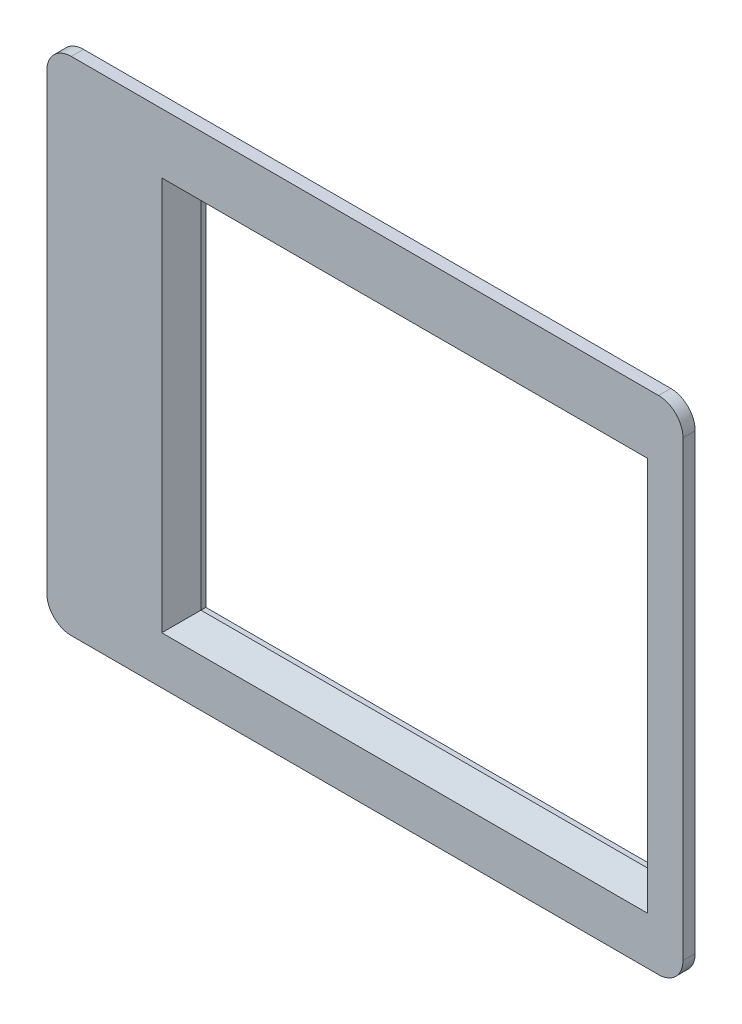
ISO-10303-21;
HEADER;
FILE_DESCRIPTION(('STEP AP214'),'2;1');
FILE_NAME('part.step','',(''),(''),'','','');
FILE_SCHEMA(('AUTOMOTIVE_DESIGN { 1 0 10303 214 1 1 1 1 }'));
ENDSEC;
DATA;
#1=APPLICATION_CONTEXT('core data for automotive mechanical design processes');
#2=APPLICATION_PROTOCOL_DEFINITION('international standard','automotive_design',2000,#1);
#3=PRODUCT_CONTEXT('',#1,'mechanical');
#4=PRODUCT('Part','Part','',(#3));
#5=PRODUCT_RELATED_PRODUCT_CATEGORY('part','',(#4));
#6=PRODUCT_DEFINITION_FORMATION('','',#4);
#7=PRODUCT_DEFINITION_CONTEXT('part definition',#1,'design');
#8=PRODUCT_DEFINITION('design','',#6,#7);
#9=PRODUCT_DEFINITION_SHAPE('','',#8);
#10=(LENGTH_UNIT() NAMED_UNIT(*) SI_UNIT(.MILLI.,.METRE.));
#11=(NAMED_UNIT(*) PLANE_ANGLE_UNIT() SI_UNIT($,.RADIAN.));
#12=(NAMED_UNIT(*) SI_UNIT($,.STERADIAN.) SOLID_ANGLE_UNIT());
#13=UNCERTAINTY_MEASURE_WITH_UNIT(LENGTH_MEASURE(1.E-05),#10,'distance_accuracy_value','');
#14=(GEOMETRIC_REPRESENTATION_CONTEXT(3) GLOBAL_UNCERTAINTY_ASSIGNED_CONTEXT((#13)) GLOBAL_UNIT_ASSIGNED_CONTEXT((#10,
#11,#12)) REPRESENTATION_CONTEXT('',''));
#15=CARTESIAN_POINT('',(0.,0.,0.));
#16=DIRECTION('',(0.,0.,1.));
#17=DIRECTION('',(1.,0.,0.));
#18=AXIS2_PLACEMENT_3D('',#15,#16,#17);
#19=CARTESIAN_POINT('',(0.,-3.,-1.));
#20=DIRECTION('',(0.,-1.,0.));
#21=DIRECTION('',(0.,0.,-1.));
#22=AXIS2_PLACEMENT_3D('',#19,#20,#21);
#23=PLANE('',#22);
#24=DIRECTION('',(1.,0.,0.));
#25=VECTOR('',#24,1.);
#26=CARTESIAN_POINT('',(0.,-3.,0.));
#27=LINE('',#26,#25);
#28=CARTESIAN_POINT('',(-1.,-3.,0.));
#29=VERTEX_POINT('',#28);
#30=CARTESIAN_POINT('',(47.,-3.,0.));
#31=VERTEX_POINT('',#30);
#32=EDGE_CURVE('E231',#29,#31,#27,.T.);
#33=ORIENTED_EDGE('',*,*,#32,.F.);
#34=DIRECTION('',(0.,0.,1.));
#35=VECTOR('',#34,1.);
#36=CARTESIAN_POINT('',(-1.,-3.,-1.));
#37=LINE('',#36,#35);
#38=CARTESIAN_POINT('',(-1.,-3.,-1.));
#39=VERTEX_POINT('',#38);
#40=EDGE_CURVE('E286',#29,#39,#37,.F.);
#41=ORIENTED_EDGE('',*,*,#40,.T.);
#42=DIRECTION('',(1.,0.,0.));
#43=VECTOR('',#42,1.);
#44=CARTESIAN_POINT('',(0.,-3.,-1.));
#45=LINE('',#44,#43);
#46=CARTESIAN_POINT('',(47.,-3.,-1.));
#47=VERTEX_POINT('',#46);
#48=EDGE_CURVE('E248',#39,#47,#45,.T.);
#49=ORIENTED_EDGE('',*,*,#48,.T.);
#50=DIRECTION('',(0.,0.,1.));
#51=VECTOR('',#50,1.);
#52=CARTESIAN_POINT('',(47.,-3.,-1.));
#53=LINE('',#52,#51);
#54=EDGE_CURVE('E283',#47,#31,#53,.T.);
#55=ORIENTED_EDGE('',*,*,#54,.T.);
#56=EDGE_LOOP('',(#33,#41,#49,#55));
#57=FACE_BOUND('',#56,.T.);
#58=ADVANCED_FACE('F37',(#57),#23,.T.);
#59=CARTESIAN_POINT('',(-3.,0.,-1.));
#60=DIRECTION('',(1.,0.,0.));
#61=DIRECTION('',(0.,1.,0.));
#62=AXIS2_PLACEMENT_3D('',#59,#60,#61);
#63=PLANE('',#62);
#64=DIRECTION('',(0.,1.,0.));
#65=VECTOR('',#64,1.);
#66=CARTESIAN_POINT('',(-3.,0.,-1.));
#67=LINE('',#66,#65);
#68=CARTESIAN_POINT('',(-3.,-1.,-1.));
#69=VERTEX_POINT('',#68);
#70=CARTESIAN_POINT('',(-3.00000000000001,36.,-1.));
#71=VERTEX_POINT('',#70);
#72=EDGE_CURVE('E257',#69,#71,#67,.T.);
#73=ORIENTED_EDGE('',*,*,#72,.F.);
#74=DIRECTION('',(0.,0.,1.));
#75=VECTOR('',#74,1.);
#76=CARTESIAN_POINT('',(-3.,-1.,0.));
#77=LINE('',#76,#75);
#78=CARTESIAN_POINT('',(-3.,-1.,0.));
#79=VERTEX_POINT('',#78);
#80=EDGE_CURVE('E272',#69,#79,#77,.T.);
#81=ORIENTED_EDGE('',*,*,#80,.T.);
#82=DIRECTION('',(0.,1.,0.));
#83=VECTOR('',#82,1.);
#84=CARTESIAN_POINT('',(-3.,0.,0.));
#85=LINE('',#84,#83);
#86=CARTESIAN_POINT('',(-3.00000000000001,36.,0.));
#87=VERTEX_POINT('',#86);
#88=EDGE_CURVE('E239',#79,#87,#85,.T.);
#89=ORIENTED_EDGE('',*,*,#88,.T.);
#90=DIRECTION('',(0.,0.,1.));
#91=VECTOR('',#90,1.);
#92=CARTESIAN_POINT('',(-3.00000000000001,36.,-1.));
#93=LINE('',#92,#91);
#94=EDGE_CURVE('E260',#87,#71,#93,.F.);
#95=ORIENTED_EDGE('',*,*,#94,.T.);
#96=EDGE_LOOP('',(#73,#81,#89,#95));
#97=FACE_BOUND('',#96,.T.);
#98=ADVANCED_FACE('F385',(#97),#63,.F.);
#99=CARTESIAN_POINT('',(0.,38.,-1.));
#100=DIRECTION('',(0.,-1.,0.));
#101=DIRECTION('',(1.,0.,0.));
#102=AXIS2_PLACEMENT_3D('',#99,#100,#101);
#103=PLANE('',#102);
#104=DIRECTION('',(1.,0.,0.));
#105=VECTOR('',#104,1.);
#106=CARTESIAN_POINT('',(0.,38.,0.));
#107=LINE('',#106,#105);
#108=CARTESIAN_POINT('',(-1.00000000000001,38.,0.));
#109=VERTEX_POINT('',#108);
#110=CARTESIAN_POINT('',(47.,38.,0.));
#111=VERTEX_POINT('',#110);
#112=EDGE_CURVE('E266',#109,#111,#107,.T.);
#113=ORIENTED_EDGE('',*,*,#112,.T.);
#114=DIRECTION('',(0.,0.,1.));
#115=VECTOR('',#114,1.);
#116=CARTESIAN_POINT('',(47.,38.,-1.));
#117=LINE('',#116,#115);
#118=CARTESIAN_POINT('',(47.,38.,-1.));
#119=VERTEX_POINT('',#118);
#120=EDGE_CURVE('E327',#111,#119,#117,.F.);
#121=ORIENTED_EDGE('',*,*,#120,.T.);
#122=DIRECTION('',(1.,0.,0.));
#123=VECTOR('',#122,1.);
#124=CARTESIAN_POINT('',(0.,38.,-1.));
#125=LINE('',#124,#123);
#126=CARTESIAN_POINT('',(-1.00000000000001,38.,-1.));
#127=VERTEX_POINT('',#126);
#128=EDGE_CURVE('E254',#127,#119,#125,.T.);
#129=ORIENTED_EDGE('',*,*,#128,.F.);
#130=DIRECTION('',(0.,0.,1.));
#131=VECTOR('',#130,1.);
#132=CARTESIAN_POINT('',(-1.00000000000001,38.,-1.));
#133=LINE('',#132,#131);
#134=EDGE_CURVE('E324',#127,#109,#133,.T.);
#135=ORIENTED_EDGE('',*,*,#134,.T.);
#136=EDGE_LOOP('',(#113,#121,#129,#135));
#137=FACE_BOUND('',#136,.T.);
#138=ADVANCED_FACE('F391',(#137),#103,.F.);
#139=CARTESIAN_POINT('',(49.,0.,-1.));
#140=DIRECTION('',(1.,0.,0.));
#141=DIRECTION('',(0.,1.,0.));
#142=AXIS2_PLACEMENT_3D('',#139,#140,#141);
#143=PLANE('',#142);
#144=DIRECTION('',(0.,1.,0.));
#145=VECTOR('',#144,1.);
#146=CARTESIAN_POINT('',(49.,0.,0.));
#147=LINE('',#146,#145);
#148=CARTESIAN_POINT('',(49.,-1.,0.));
#149=VERTEX_POINT('',#148);
#150=CARTESIAN_POINT('',(49.,36.,0.));
#151=VERTEX_POINT('',#150);
#152=EDGE_CURVE('E263',#149,#151,#147,.T.);
#153=ORIENTED_EDGE('',*,*,#152,.F.);
#154=DIRECTION('',(0.,0.,1.));
#155=VECTOR('',#154,1.);
#156=CARTESIAN_POINT('',(49.,-1.,-1.));
#157=LINE('',#156,#155);
#158=CARTESIAN_POINT('',(49.,-1.,-1.));
#159=VERTEX_POINT('',#158);
#160=EDGE_CURVE('E317',#149,#159,#157,.F.);
#161=ORIENTED_EDGE('',*,*,#160,.T.);
#162=DIRECTION('',(0.,1.,0.));
#163=VECTOR('',#162,1.);
#164=CARTESIAN_POINT('',(49.,0.,-1.));
#165=LINE('',#164,#163);
#166=CARTESIAN_POINT('',(49.,36.,-1.));
#167=VERTEX_POINT('',#166);
#168=EDGE_CURVE('E251',#159,#167,#165,.T.);
#169=ORIENTED_EDGE('',*,*,#168,.T.);
#170=DIRECTION('',(0.,0.,1.));
#171=VECTOR('',#170,1.);
#172=CARTESIAN_POINT('',(49.,36.,0.));
#173=LINE('',#172,#171);
#174=EDGE_CURVE('E314',#167,#151,#173,.T.);
#175=ORIENTED_EDGE('',*,*,#174,.T.);
#176=EDGE_LOOP('',(#153,#161,#169,#175));
#177=FACE_BOUND('',#176,.T.);
#178=ADVANCED_FACE('F397',(#177),#143,.T.);
#179=CARTESIAN_POINT('',(0.,0.,-1.));
#180=DIRECTION('',(0.,0.,1.));
#181=DIRECTION('',(1.,0.,0.));
#182=AXIS2_PLACEMENT_3D('',#179,#180,#181);
#183=PLANE('',#182);
#184=DIRECTION('',(1.,0.,0.));
#185=VECTOR('',#184,1.);
#186=CARTESIAN_POINT('',(0.,0.,-1.));
#187=LINE('',#186,#185);
#188=CARTESIAN_POINT('',(2.,0.,-1.));
#189=VERTEX_POINT('',#188);
#190=CARTESIAN_POINT('',(44.,0.,-1.));
#191=VERTEX_POINT('',#190);
#192=EDGE_CURVE('E238',#189,#191,#187,.T.);
#193=ORIENTED_EDGE('',*,*,#192,.T.);
#194=CARTESIAN_POINT('',(44.,2.,-1.));
#195=DIRECTION('',(0.,0.,1.));
#196=DIRECTION('',(1.,0.,0.));
#197=AXIS2_PLACEMENT_3D('',#194,#195,#196);
#198=CIRCLE('',#197,2.);
#199=CARTESIAN_POINT('',(46.,2.,-1.));
#200=VERTEX_POINT('',#199);
#201=EDGE_CURVE('E336',#191,#200,#198,.T.);
#202=ORIENTED_EDGE('',*,*,#201,.T.);
#203=DIRECTION('',(0.,1.,0.));
#204=VECTOR('',#203,1.);
#205=CARTESIAN_POINT('',(46.,0.,-1.));
#206=LINE('',#205,#204);
#207=CARTESIAN_POINT('',(46.,33.,-1.));
#208=VERTEX_POINT('',#207);
#209=EDGE_CURVE('E235',#200,#208,#206,.T.);
#210=ORIENTED_EDGE('',*,*,#209,.T.);
#211=CARTESIAN_POINT('',(44.,33.,-1.));
#212=DIRECTION('',(0.,0.,1.));
#213=DIRECTION('',(1.,0.,0.));
#214=AXIS2_PLACEMENT_3D('',#211,#212,#213);
#215=CIRCLE('',#214,2.);
#216=CARTESIAN_POINT('',(44.,35.,-1.));
#217=VERTEX_POINT('',#216);
#218=EDGE_CURVE('E338',#208,#217,#215,.T.);
#219=ORIENTED_EDGE('',*,*,#218,.T.);
#220=DIRECTION('',(1.,0.,0.));
#221=VECTOR('',#220,1.);
#222=CARTESIAN_POINT('',(0.,35.,-1.));
#223=LINE('',#222,#221);
#224=CARTESIAN_POINT('',(2.,35.,-1.));
#225=VERTEX_POINT('',#224);
#226=EDGE_CURVE('E245',#225,#217,#223,.T.);
#227=ORIENTED_EDGE('',*,*,#226,.F.);
#228=CARTESIAN_POINT('',(2.,33.,-1.));
#229=DIRECTION('',(0.,0.,1.));
#230=DIRECTION('',(1.,0.,0.));
#231=AXIS2_PLACEMENT_3D('',#228,#229,#230);
#232=CIRCLE('',#231,2.);
#233=CARTESIAN_POINT('',(0.,33.,-1.));
#234=VERTEX_POINT('',#233);
#235=EDGE_CURVE('E340',#225,#234,#232,.T.);
#236=ORIENTED_EDGE('',*,*,#235,.T.);
#237=DIRECTION('',(0.,1.,0.));
#238=VECTOR('',#237,1.);
#239=CARTESIAN_POINT('',(0.,0.,-1.));
#240=LINE('',#239,#238);
#241=CARTESIAN_POINT('',(0.,2.,-1.));
#242=VERTEX_POINT('',#241);
#243=EDGE_CURVE('E242',#242,#234,#240,.T.);
#244=ORIENTED_EDGE('',*,*,#243,.F.);
#245=CARTESIAN_POINT('',(2.,2.,-1.));
#246=DIRECTION('',(0.,0.,1.));
#247=DIRECTION('',(1.,0.,0.));
#248=AXIS2_PLACEMENT_3D('',#245,#246,#247);
#249=CIRCLE('',#248,2.);
#250=EDGE_CURVE('E334',#242,#189,#249,.T.);
#251=ORIENTED_EDGE('',*,*,#250,.T.);
#252=EDGE_LOOP('',(#193,#202,#210,#219,#227,#236,#244,#251));
#253=FACE_BOUND('',#252,.T.);
#254=ORIENTED_EDGE('',*,*,#48,.F.);
#255=CARTESIAN_POINT('',(-1.,-1.,-1.));
#256=DIRECTION('',(0.,0.,1.));
#257=DIRECTION('',(1.,0.,0.));
#258=AXIS2_PLACEMENT_3D('',#255,#256,#257);
#259=CIRCLE('',#258,2.);
#260=EDGE_CURVE('E294',#39,#69,#259,.F.);
#261=ORIENTED_EDGE('',*,*,#260,.T.);
#262=ORIENTED_EDGE('',*,*,#72,.T.);
#263=CARTESIAN_POINT('',(-1.00000000000001,36.,-1.));
#264=DIRECTION('',(0.,0.,1.));
#265=DIRECTION('',(1.,0.,0.));
#266=AXIS2_PLACEMENT_3D('',#263,#264,#265);
#267=CIRCLE('',#266,2.);
#268=EDGE_CURVE('E288',#71,#127,#267,.F.);
#269=ORIENTED_EDGE('',*,*,#268,.T.);
#270=ORIENTED_EDGE('',*,*,#128,.T.);
#271=CARTESIAN_POINT('',(47.,36.,-1.));
#272=DIRECTION('',(0.,0.,1.));
#273=DIRECTION('',(1.,0.,0.));
#274=AXIS2_PLACEMENT_3D('',#271,#272,#273);
#275=CIRCLE('',#274,2.);
#276=EDGE_CURVE('E290',#119,#167,#275,.F.);
#277=ORIENTED_EDGE('',*,*,#276,.T.);
#278=ORIENTED_EDGE('',*,*,#168,.F.);
#279=CARTESIAN_POINT('',(47.,-1.,-1.));
#280=DIRECTION('',(0.,0.,1.));
#281=DIRECTION('',(1.,0.,0.));
#282=AXIS2_PLACEMENT_3D('',#279,#280,#281);
#283=CIRCLE('',#282,2.);
#284=EDGE_CURVE('E292',#159,#47,#283,.F.);
#285=ORIENTED_EDGE('',*,*,#284,.T.);
#286=EDGE_LOOP('',(#254,#261,#262,#269,#270,#277,#278,#285));
#287=FACE_BOUND('',#286,.T.);
#288=ADVANCED_FACE('F552',(#253,#287),#183,.F.);
#289=CARTESIAN_POINT('',(0.,0.,0.));
#290=DIRECTION('',(0.,0.,1.));
#291=DIRECTION('',(1.,0.,0.));
#292=AXIS2_PLACEMENT_3D('',#289,#290,#291);
#293=PLANE('',#292);
#294=DIRECTION('',(0.,-1.,0.));
#295=VECTOR('',#294,1.);
#296=CARTESIAN_POINT('',(46.1,2.5,0.));
#297=LINE('',#296,#295);
#298=CARTESIAN_POINT('',(46.1,33.1,0.));
#299=VERTEX_POINT('',#298);
#300=CARTESIAN_POINT('',(46.1,0.900000000000003,0.));
#301=VERTEX_POINT('',#300);
#302=EDGE_CURVE('E347',#299,#301,#297,.T.);
#303=ORIENTED_EDGE('',*,*,#302,.T.);
#304=DIRECTION('',(-1.,0.,0.));
#305=VECTOR('',#304,1.);
#306=CARTESIAN_POINT('',(8.,0.900000000000003,0.));
#307=LINE('',#306,#305);
#308=CARTESIAN_POINT('',(6.4,0.900000000000003,0.));
#309=VERTEX_POINT('',#308);
#310=EDGE_CURVE('E349',#301,#309,#307,.T.);
#311=ORIENTED_EDGE('',*,*,#310,.T.);
#312=DIRECTION('',(0.,1.,0.));
#313=VECTOR('',#312,1.);
#314=CARTESIAN_POINT('',(6.4,0.,0.));
#315=LINE('',#314,#313);
#316=CARTESIAN_POINT('',(6.4,33.1,0.));
#317=VERTEX_POINT('',#316);
#318=EDGE_CURVE('E345',#309,#317,#315,.T.);
#319=ORIENTED_EDGE('',*,*,#318,.T.);
#320=DIRECTION('',(1.,0.,0.));
#321=VECTOR('',#320,1.);
#322=CARTESIAN_POINT('',(0.,33.1,0.));
#323=LINE('',#322,#321);
#324=EDGE_CURVE('E343',#317,#299,#323,.T.);
#325=ORIENTED_EDGE('',*,*,#324,.T.);
#326=EDGE_LOOP('',(#303,#311,#319,#325));
#327=FACE_BOUND('',#326,.T.);
#328=ORIENTED_EDGE('',*,*,#88,.F.);
#329=CARTESIAN_POINT('',(-1.,-1.,0.));
#330=DIRECTION('',(0.,0.,1.));
#331=DIRECTION('',(1.,0.,0.));
#332=AXIS2_PLACEMENT_3D('',#329,#330,#331);
#333=CIRCLE('',#332,2.);
#334=EDGE_CURVE('E281',#79,#29,#333,.T.);
#335=ORIENTED_EDGE('',*,*,#334,.T.);
#336=ORIENTED_EDGE('',*,*,#32,.T.);
#337=CARTESIAN_POINT('',(47.,-1.,0.));
#338=DIRECTION('',(0.,0.,1.));
#339=DIRECTION('',(1.,0.,0.));
#340=AXIS2_PLACEMENT_3D('',#337,#338,#339);
#341=CIRCLE('',#340,2.);
#342=EDGE_CURVE('E279',#31,#149,#341,.T.);
#343=ORIENTED_EDGE('',*,*,#342,.T.);
#344=ORIENTED_EDGE('',*,*,#152,.T.);
#345=CARTESIAN_POINT('',(47.,36.,0.));
#346=DIRECTION('',(0.,0.,1.));
#347=DIRECTION('',(1.,0.,0.));
#348=AXIS2_PLACEMENT_3D('',#345,#346,#347);
#349=CIRCLE('',#348,2.);
#350=EDGE_CURVE('E277',#151,#111,#349,.T.);
#351=ORIENTED_EDGE('',*,*,#350,.T.);
#352=ORIENTED_EDGE('',*,*,#112,.F.);
#353=CARTESIAN_POINT('',(-1.00000000000001,36.,0.));
#354=DIRECTION('',(0.,0.,1.));
#355=DIRECTION('',(1.,0.,0.));
#356=AXIS2_PLACEMENT_3D('',#353,#354,#355);
#357=CIRCLE('',#356,2.);
#358=EDGE_CURVE('E275',#109,#87,#357,.T.);
#359=ORIENTED_EDGE('',*,*,#358,.T.);
#360=EDGE_LOOP('',(#328,#335,#336,#343,#344,#351,#352,#359));
#361=FACE_BOUND('',#360,.T.);
#362=ADVANCED_FACE('F544',(#327,#361),#293,.T.);
#363=CARTESIAN_POINT('',(0.,0.,-2.));
#364=DIRECTION('',(0.,-1.,0.));
#365=DIRECTION('',(0.,0.,-1.));
#366=AXIS2_PLACEMENT_3D('',#363,#364,#365);
#367=PLANE('',#366);
#368=ORIENTED_EDGE('',*,*,#192,.F.);
#369=DIRECTION('',(0.,0.,1.));
#370=VECTOR('',#369,1.);
#371=CARTESIAN_POINT('',(2.,0.,-2.));
#372=LINE('',#371,#370);
#373=CARTESIAN_POINT('',(2.,0.,-2.));
#374=VERTEX_POINT('',#373);
#375=EDGE_CURVE('E304',#189,#374,#372,.F.);
#376=ORIENTED_EDGE('',*,*,#375,.T.);
#377=DIRECTION('',(1.,0.,0.));
#378=VECTOR('',#377,1.);
#379=CARTESIAN_POINT('',(0.,0.,-2.));
#380=LINE('',#379,#378);
#381=CARTESIAN_POINT('',(44.,0.,-2.));
#382=VERTEX_POINT('',#381);
#383=EDGE_CURVE('E219',#374,#382,#380,.T.);
#384=ORIENTED_EDGE('',*,*,#383,.T.);
#385=DIRECTION('',(0.,0.,1.));
#386=VECTOR('',#385,1.);
#387=CARTESIAN_POINT('',(44.,0.,-2.));
#388=LINE('',#387,#386);
#389=EDGE_CURVE('E301',#382,#191,#388,.T.);
#390=ORIENTED_EDGE('',*,*,#389,.T.);
#391=EDGE_LOOP('',(#368,#376,#384,#390));
#392=FACE_BOUND('',#391,.T.);
#393=ADVANCED_FACE('F536',(#392),#367,.T.);
#394=CARTESIAN_POINT('',(0.,0.,-2.));
#395=DIRECTION('',(1.,0.,0.));
#396=DIRECTION('',(0.,0.,-1.));
#397=AXIS2_PLACEMENT_3D('',#394,#395,#396);
#398=PLANE('',#397);
#399=DIRECTION('',(0.,1.,0.));
#400=VECTOR('',#399,1.);
#401=CARTESIAN_POINT('',(0.,0.,-2.));
#402=LINE('',#401,#400);
#403=CARTESIAN_POINT('',(0.,2.,-2.));
#404=VERTEX_POINT('',#403);
#405=CARTESIAN_POINT('',(0.,33.,-2.));
#406=VERTEX_POINT('',#405);
#407=EDGE_CURVE('E207',#404,#406,#402,.T.);
#408=ORIENTED_EDGE('',*,*,#407,.F.);
#409=DIRECTION('',(0.,0.,1.));
#410=VECTOR('',#409,1.);
#411=CARTESIAN_POINT('',(0.,2.,-1.));
#412=LINE('',#411,#410);
#413=EDGE_CURVE('E298',#404,#242,#412,.T.);
#414=ORIENTED_EDGE('',*,*,#413,.T.);
#415=ORIENTED_EDGE('',*,*,#243,.T.);
#416=DIRECTION('',(0.,0.,1.));
#417=VECTOR('',#416,1.);
#418=CARTESIAN_POINT('',(0.,33.,-2.));
#419=LINE('',#418,#417);
#420=EDGE_CURVE('E296',#234,#406,#419,.F.);
#421=ORIENTED_EDGE('',*,*,#420,.T.);
#422=EDGE_LOOP('',(#408,#414,#415,#421));
#423=FACE_BOUND('',#422,.T.);
#424=ADVANCED_FACE('F528',(#423),#398,.F.);
#425=CARTESIAN_POINT('',(0.,35.,-2.));
#426=DIRECTION('',(0.,-1.,0.));
#427=DIRECTION('',(0.,0.,-1.));
#428=AXIS2_PLACEMENT_3D('',#425,#426,#427);
#429=PLANE('',#428);
#430=ORIENTED_EDGE('',*,*,#226,.T.);
#431=DIRECTION('',(0.,0.,1.));
#432=VECTOR('',#431,1.);
#433=CARTESIAN_POINT('',(44.,35.,-2.));
#434=LINE('',#433,#432);
#435=CARTESIAN_POINT('',(44.,35.,-2.));
#436=VERTEX_POINT('',#435);
#437=EDGE_CURVE('E332',#217,#436,#434,.F.);
#438=ORIENTED_EDGE('',*,*,#437,.T.);
#439=DIRECTION('',(1.,0.,0.));
#440=VECTOR('',#439,1.);
#441=CARTESIAN_POINT('',(0.,35.,-2.));
#442=LINE('',#441,#440);
#443=CARTESIAN_POINT('',(2.,35.,-2.));
#444=VERTEX_POINT('',#443);
#445=EDGE_CURVE('E225',#444,#436,#442,.T.);
#446=ORIENTED_EDGE('',*,*,#445,.F.);
#447=DIRECTION('',(0.,0.,1.));
#448=VECTOR('',#447,1.);
#449=CARTESIAN_POINT('',(2.,35.,-2.));
#450=LINE('',#449,#448);
#451=EDGE_CURVE('E329',#444,#225,#450,.T.);
#452=ORIENTED_EDGE('',*,*,#451,.T.);
#453=EDGE_LOOP('',(#430,#438,#446,#452));
#454=FACE_BOUND('',#453,.T.);
#455=ADVANCED_FACE('F521',(#454),#429,.F.);
#456=CARTESIAN_POINT('',(46.,0.,-2.));
#457=DIRECTION('',(1.,0.,0.));
#458=DIRECTION('',(0.,0.,-1.));
#459=AXIS2_PLACEMENT_3D('',#456,#457,#458);
#460=PLANE('',#459);
#461=ORIENTED_EDGE('',*,*,#209,.F.);
#462=DIRECTION('',(0.,0.,1.));
#463=VECTOR('',#462,1.);
#464=CARTESIAN_POINT('',(46.,2.,-2.));
#465=LINE('',#464,#463);
#466=CARTESIAN_POINT('',(46.,2.,-2.));
#467=VERTEX_POINT('',#466);
#468=EDGE_CURVE('E322',#200,#467,#465,.F.);
#469=ORIENTED_EDGE('',*,*,#468,.T.);
#470=DIRECTION('',(0.,1.,0.));
#471=VECTOR('',#470,1.);
#472=CARTESIAN_POINT('',(46.,0.,-2.));
#473=LINE('',#472,#471);
#474=CARTESIAN_POINT('',(46.,33.,-2.));
#475=VERTEX_POINT('',#474);
#476=EDGE_CURVE('E222',#467,#475,#473,.T.);
#477=ORIENTED_EDGE('',*,*,#476,.T.);
#478=DIRECTION('',(0.,0.,1.));
#479=VECTOR('',#478,1.);
#480=CARTESIAN_POINT('',(46.,33.,-1.));
#481=LINE('',#480,#479);
#482=EDGE_CURVE('E319',#475,#208,#481,.T.);
#483=ORIENTED_EDGE('',*,*,#482,.T.);
#484=EDGE_LOOP('',(#461,#469,#477,#483));
#485=FACE_BOUND('',#484,.T.);
#486=ADVANCED_FACE('F381',(#485),#460,.T.);
#487=CARTESIAN_POINT('',(44.5,0.,-2.));
#488=DIRECTION('',(1.,0.,0.));
#489=DIRECTION('',(0.,0.,-1.));
#490=AXIS2_PLACEMENT_3D('',#487,#488,#489);
#491=PLANE('',#490);
#492=DIRECTION('',(0.,0.,1.));
#493=VECTOR('',#492,1.);
#494=CARTESIAN_POINT('',(44.5,2.5,-2.));
#495=LINE('',#494,#493);
#496=CARTESIAN_POINT('',(44.5,2.5,-2.));
#497=VERTEX_POINT('',#496);
#498=CARTESIAN_POINT('',(44.5,2.5,-1.6));
#499=VERTEX_POINT('',#498);
#500=EDGE_CURVE('E202',#497,#499,#495,.T.);
#501=ORIENTED_EDGE('',*,*,#500,.T.);
#502=DIRECTION('',(0.,1.,0.));
#503=VECTOR('',#502,1.);
#504=CARTESIAN_POINT('',(44.5,31.5,-1.6));
#505=LINE('',#504,#503);
#506=CARTESIAN_POINT('',(44.5,31.5,-1.6));
#507=VERTEX_POINT('',#506);
#508=EDGE_CURVE('E61',#499,#507,#505,.T.);
#509=ORIENTED_EDGE('',*,*,#508,.T.);
#510=DIRECTION('',(0.,0.,1.));
#511=VECTOR('',#510,1.);
#512=CARTESIAN_POINT('',(44.5,31.5,-2.));
#513=LINE('',#512,#511);
#514=CARTESIAN_POINT('',(44.5,31.5,-2.));
#515=VERTEX_POINT('',#514);
#516=EDGE_CURVE('E210',#515,#507,#513,.T.);
#517=ORIENTED_EDGE('',*,*,#516,.F.);
#518=DIRECTION('',(0.,1.,0.));
#519=VECTOR('',#518,1.);
#520=CARTESIAN_POINT('',(44.5,0.,-2.));
#521=LINE('',#520,#519);
#522=EDGE_CURVE('E195',#497,#515,#521,.T.);
#523=ORIENTED_EDGE('',*,*,#522,.F.);
#524=EDGE_LOOP('',(#501,#509,#517,#523));
#525=FACE_BOUND('',#524,.T.);
#526=ADVANCED_FACE('F209',(#525),#491,.F.);
#527=CARTESIAN_POINT('',(0.,31.5,-2.));
#528=DIRECTION('',(0.,-1.,0.));
#529=DIRECTION('',(0.,0.,-1.));
#530=AXIS2_PLACEMENT_3D('',#527,#528,#529);
#531=PLANE('',#530);
#532=ORIENTED_EDGE('',*,*,#516,.T.);
#533=DIRECTION('',(-1.,0.,0.));
#534=VECTOR('',#533,1.);
#535=CARTESIAN_POINT('',(0.,31.5,-1.6));
#536=LINE('',#535,#534);
#537=CARTESIAN_POINT('',(8.,31.5,-1.6));
#538=VERTEX_POINT('',#537);
#539=EDGE_CURVE('E11',#507,#538,#536,.T.);
#540=ORIENTED_EDGE('',*,*,#539,.T.);
#541=DIRECTION('',(0.,0.,1.));
#542=VECTOR('',#541,1.);
#543=CARTESIAN_POINT('',(8.,31.5,-2.));
#544=LINE('',#543,#542);
#545=CARTESIAN_POINT('',(8.,31.5,-2.));
#546=VERTEX_POINT('',#545);
#547=EDGE_CURVE('E232',#546,#538,#544,.T.);
#548=ORIENTED_EDGE('',*,*,#547,.F.);
#549=DIRECTION('',(1.,0.,0.));
#550=VECTOR('',#549,1.);
#551=CARTESIAN_POINT('',(0.,31.5,-2.));
#552=LINE('',#551,#550);
#553=EDGE_CURVE('E217',#546,#515,#552,.T.);
#554=ORIENTED_EDGE('',*,*,#553,.T.);
#555=EDGE_LOOP('',(#532,#540,#548,#554));
#556=FACE_BOUND('',#555,.T.);
#557=ADVANCED_FACE('F373',(#556),#531,.T.);
#558=CARTESIAN_POINT('',(8.,0.,-2.));
#559=DIRECTION('',(1.,0.,0.));
#560=DIRECTION('',(0.,0.,-1.));
#561=AXIS2_PLACEMENT_3D('',#558,#559,#560);
#562=PLANE('',#561);
#563=ORIENTED_EDGE('',*,*,#547,.T.);
#564=DIRECTION('',(0.,-1.,0.));
#565=VECTOR('',#564,1.);
#566=CARTESIAN_POINT('',(8.,0.,-1.6));
#567=LINE('',#566,#565);
#568=CARTESIAN_POINT('',(8.,2.5,-1.6));
#569=VERTEX_POINT('',#568);
#570=EDGE_CURVE('E47',#538,#569,#567,.T.);
#571=ORIENTED_EDGE('',*,*,#570,.T.);
#572=DIRECTION('',(0.,0.,1.));
#573=VECTOR('',#572,1.);
#574=CARTESIAN_POINT('',(8.,2.5,-2.));
#575=LINE('',#574,#573);
#576=CARTESIAN_POINT('',(8.,2.5,-2.));
#577=VERTEX_POINT('',#576);
#578=EDGE_CURVE('E206',#577,#569,#575,.T.);
#579=ORIENTED_EDGE('',*,*,#578,.F.);
#580=DIRECTION('',(0.,1.,0.));
#581=VECTOR('',#580,1.);
#582=CARTESIAN_POINT('',(8.,0.,-2.));
#583=LINE('',#582,#581);
#584=EDGE_CURVE('E197',#577,#546,#583,.T.);
#585=ORIENTED_EDGE('',*,*,#584,.T.);
#586=EDGE_LOOP('',(#563,#571,#579,#585));
#587=FACE_BOUND('',#586,.T.);
#588=ADVANCED_FACE('F372',(#587),#562,.T.);
#589=CARTESIAN_POINT('',(0.,2.5,-2.));
#590=DIRECTION('',(0.,-1.,0.));
#591=DIRECTION('',(0.,0.,-1.));
#592=AXIS2_PLACEMENT_3D('',#589,#590,#591);
#593=PLANE('',#592);
#594=ORIENTED_EDGE('',*,*,#578,.T.);
#595=DIRECTION('',(1.,0.,0.));
#596=VECTOR('',#595,1.);
#597=CARTESIAN_POINT('',(44.5,2.5,-1.6));
#598=LINE('',#597,#596);
#599=EDGE_CURVE('E205',#569,#499,#598,.T.);
#600=ORIENTED_EDGE('',*,*,#599,.T.);
#601=ORIENTED_EDGE('',*,*,#500,.F.);
#602=DIRECTION('',(1.,0.,0.));
#603=VECTOR('',#602,1.);
#604=CARTESIAN_POINT('',(0.,2.5,-2.));
#605=LINE('',#604,#603);
#606=EDGE_CURVE('E189',#577,#497,#605,.T.);
#607=ORIENTED_EDGE('',*,*,#606,.F.);
#608=EDGE_LOOP('',(#594,#600,#601,#607));
#609=FACE_BOUND('',#608,.T.);
#610=ADVANCED_FACE('F203',(#609),#593,.F.);
#611=CARTESIAN_POINT('',(0.,0.,-2.));
#612=DIRECTION('',(0.,0.,1.));
#613=DIRECTION('',(1.,0.,0.));
#614=AXIS2_PLACEMENT_3D('',#611,#612,#613);
#615=PLANE('',#614);
#616=ORIENTED_EDGE('',*,*,#522,.T.);
#617=ORIENTED_EDGE('',*,*,#553,.F.);
#618=ORIENTED_EDGE('',*,*,#584,.F.);
#619=ORIENTED_EDGE('',*,*,#606,.T.);
#620=EDGE_LOOP('',(#616,#617,#618,#619));
#621=FACE_BOUND('',#620,.T.);
#622=ORIENTED_EDGE('',*,*,#383,.F.);
#623=CARTESIAN_POINT('',(2.,2.,-2.));
#624=DIRECTION('',(0.,0.,1.));
#625=DIRECTION('',(1.,0.,0.));
#626=AXIS2_PLACEMENT_3D('',#623,#624,#625);
#627=CIRCLE('',#626,2.);
#628=EDGE_CURVE('E312',#374,#404,#627,.F.);
#629=ORIENTED_EDGE('',*,*,#628,.T.);
#630=ORIENTED_EDGE('',*,*,#407,.T.);
#631=CARTESIAN_POINT('',(2.,33.,-2.));
#632=DIRECTION('',(0.,0.,1.));
#633=DIRECTION('',(1.,0.,0.));
#634=AXIS2_PLACEMENT_3D('',#631,#632,#633);
#635=CIRCLE('',#634,2.);
#636=EDGE_CURVE('E306',#406,#444,#635,.F.);
#637=ORIENTED_EDGE('',*,*,#636,.T.);
#638=ORIENTED_EDGE('',*,*,#445,.T.);
#639=CARTESIAN_POINT('',(44.,33.,-2.));
#640=DIRECTION('',(0.,0.,1.));
#641=DIRECTION('',(1.,0.,0.));
#642=AXIS2_PLACEMENT_3D('',#639,#640,#641);
#643=CIRCLE('',#642,2.);
#644=EDGE_CURVE('E308',#436,#475,#643,.F.);
#645=ORIENTED_EDGE('',*,*,#644,.T.);
#646=ORIENTED_EDGE('',*,*,#476,.F.);
#647=CARTESIAN_POINT('',(44.,2.,-2.));
#648=DIRECTION('',(0.,0.,1.));
#649=DIRECTION('',(1.,0.,0.));
#650=AXIS2_PLACEMENT_3D('',#647,#648,#649);
#651=CIRCLE('',#650,2.);
#652=EDGE_CURVE('E310',#467,#382,#651,.F.);
#653=ORIENTED_EDGE('',*,*,#652,.T.);
#654=EDGE_LOOP('',(#622,#629,#630,#637,#638,#645,#646,#653));
#655=FACE_BOUND('',#654,.T.);
#656=ADVANCED_FACE('F191',(#621,#655),#615,.F.);
#657=CARTESIAN_POINT('',(-1.,-1.,-1.));
#658=DIRECTION('',(0.,0.,-1.));
#659=DIRECTION('',(-1.,0.,0.));
#660=AXIS2_PLACEMENT_3D('',#657,#658,#659);
#661=CYLINDRICAL_SURFACE('',#660,2.);
#662=ORIENTED_EDGE('',*,*,#260,.F.);
#663=ORIENTED_EDGE('',*,*,#40,.F.);
#664=ORIENTED_EDGE('',*,*,#334,.F.);
#665=ORIENTED_EDGE('',*,*,#80,.F.);
#666=EDGE_LOOP('',(#662,#663,#664,#665));
#667=FACE_BOUND('',#666,.T.);
#668=ADVANCED_FACE('F399',(#667),#661,.T.);
#669=CARTESIAN_POINT('',(2.,2.,-2.));
#670=DIRECTION('',(0.,0.,-1.));
#671=DIRECTION('',(-1.,0.,0.));
#672=AXIS2_PLACEMENT_3D('',#669,#670,#671);
#673=CYLINDRICAL_SURFACE('',#672,2.);
#674=ORIENTED_EDGE('',*,*,#628,.F.);
#675=ORIENTED_EDGE('',*,*,#375,.F.);
#676=ORIENTED_EDGE('',*,*,#250,.F.);
#677=ORIENTED_EDGE('',*,*,#413,.F.);
#678=EDGE_LOOP('',(#674,#675,#676,#677));
#679=FACE_BOUND('',#678,.T.);
#680=ADVANCED_FACE('F402',(#679),#673,.T.);
#681=CARTESIAN_POINT('',(47.,-1.,-1.));
#682=DIRECTION('',(0.,0.,1.));
#683=DIRECTION('',(1.,0.,0.));
#684=AXIS2_PLACEMENT_3D('',#681,#682,#683);
#685=CYLINDRICAL_SURFACE('',#684,2.);
#686=ORIENTED_EDGE('',*,*,#284,.F.);
#687=ORIENTED_EDGE('',*,*,#160,.F.);
#688=ORIENTED_EDGE('',*,*,#342,.F.);
#689=ORIENTED_EDGE('',*,*,#54,.F.);
#690=EDGE_LOOP('',(#686,#687,#688,#689));
#691=FACE_BOUND('',#690,.T.);
#692=ADVANCED_FACE('F406',(#691),#685,.T.);
#693=CARTESIAN_POINT('',(44.,2.,-2.));
#694=DIRECTION('',(0.,0.,1.));
#695=DIRECTION('',(1.,0.,0.));
#696=AXIS2_PLACEMENT_3D('',#693,#694,#695);
#697=CYLINDRICAL_SURFACE('',#696,2.);
#698=ORIENTED_EDGE('',*,*,#652,.F.);
#699=ORIENTED_EDGE('',*,*,#468,.F.);
#700=ORIENTED_EDGE('',*,*,#201,.F.);
#701=ORIENTED_EDGE('',*,*,#389,.F.);
#702=EDGE_LOOP('',(#698,#699,#700,#701));
#703=FACE_BOUND('',#702,.T.);
#704=ADVANCED_FACE('F410',(#703),#697,.T.);
#705=CARTESIAN_POINT('',(47.,36.,-1.));
#706=DIRECTION('',(0.,0.,-1.));
#707=DIRECTION('',(-1.,0.,0.));
#708=AXIS2_PLACEMENT_3D('',#705,#706,#707);
#709=CYLINDRICAL_SURFACE('',#708,2.);
#710=ORIENTED_EDGE('',*,*,#276,.F.);
#711=ORIENTED_EDGE('',*,*,#120,.F.);
#712=ORIENTED_EDGE('',*,*,#350,.F.);
#713=ORIENTED_EDGE('',*,*,#174,.F.);
#714=EDGE_LOOP('',(#710,#711,#712,#713));
#715=FACE_BOUND('',#714,.T.);
#716=ADVANCED_FACE('F414',(#715),#709,.T.);
#717=CARTESIAN_POINT('',(44.,33.,-2.));
#718=DIRECTION('',(0.,0.,-1.));
#719=DIRECTION('',(-1.,0.,0.));
#720=AXIS2_PLACEMENT_3D('',#717,#718,#719);
#721=CYLINDRICAL_SURFACE('',#720,2.);
#722=ORIENTED_EDGE('',*,*,#644,.F.);
#723=ORIENTED_EDGE('',*,*,#437,.F.);
#724=ORIENTED_EDGE('',*,*,#218,.F.);
#725=ORIENTED_EDGE('',*,*,#482,.F.);
#726=EDGE_LOOP('',(#722,#723,#724,#725));
#727=FACE_BOUND('',#726,.T.);
#728=ADVANCED_FACE('F418',(#727),#721,.T.);
#729=CARTESIAN_POINT('',(-1.00000000000001,36.,-1.));
#730=DIRECTION('',(0.,0.,1.));
#731=DIRECTION('',(1.,0.,0.));
#732=AXIS2_PLACEMENT_3D('',#729,#730,#731);
#733=CYLINDRICAL_SURFACE('',#732,2.);
#734=ORIENTED_EDGE('',*,*,#268,.F.);
#735=ORIENTED_EDGE('',*,*,#94,.F.);
#736=ORIENTED_EDGE('',*,*,#358,.F.);
#737=ORIENTED_EDGE('',*,*,#134,.F.);
#738=EDGE_LOOP('',(#734,#735,#736,#737));
#739=FACE_BOUND('',#738,.T.);
#740=ADVANCED_FACE('F422',(#739),#733,.T.);
#741=CARTESIAN_POINT('',(2.,33.,-2.));
#742=DIRECTION('',(0.,0.,1.));
#743=DIRECTION('',(1.,0.,0.));
#744=AXIS2_PLACEMENT_3D('',#741,#742,#743);
#745=CYLINDRICAL_SURFACE('',#744,2.);
#746=ORIENTED_EDGE('',*,*,#636,.F.);
#747=ORIENTED_EDGE('',*,*,#420,.F.);
#748=ORIENTED_EDGE('',*,*,#235,.F.);
#749=ORIENTED_EDGE('',*,*,#451,.F.);
#750=EDGE_LOOP('',(#746,#747,#748,#749));
#751=FACE_BOUND('',#750,.T.);
#752=ADVANCED_FACE('F426',(#751),#745,.T.);
#753=CARTESIAN_POINT('',(0.,33.1,0.));
#754=DIRECTION('',(0.,0.707106781186549,-0.707106781186546));
#755=DIRECTION('',(1.,0.,0.));
#756=AXIS2_PLACEMENT_3D('',#753,#754,#755);
#757=PLANE('',#756);
#758=DIRECTION('',(-0.577350269189625,-0.577350269189625,-0.577350269189628));
#759=VECTOR('',#758,1.);
#760=CARTESIAN_POINT('',(34.,21.,-12.1));
#761=LINE('',#760,#759);
#762=EDGE_CURVE('E214',#299,#507,#761,.T.);
#763=ORIENTED_EDGE('',*,*,#762,.F.);
#764=ORIENTED_EDGE('',*,*,#324,.F.);
#765=DIRECTION('',(0.577350269189625,-0.577350269189625,-0.577350269189628));
#766=VECTOR('',#765,1.);
#767=CARTESIAN_POINT('',(17.4333333333333,22.0666666666667,-11.0333333333333));
#768=LINE('',#767,#766);
#769=EDGE_CURVE('E42',#538,#317,#768,.F.);
#770=ORIENTED_EDGE('',*,*,#769,.F.);
#771=ORIENTED_EDGE('',*,*,#539,.F.);
#772=EDGE_LOOP('',(#763,#764,#770,#771));
#773=FACE_BOUND('',#772,.T.);
#774=ADVANCED_FACE('F40',(#773),#757,.F.);
#775=CARTESIAN_POINT('',(6.4,0.,0.));
#776=DIRECTION('',(-0.707106781186549,0.,-0.707106781186546));
#777=DIRECTION('',(0.,1.,0.));
#778=AXIS2_PLACEMENT_3D('',#775,#776,#777);
#779=PLANE('',#778);
#780=ORIENTED_EDGE('',*,*,#769,.T.);
#781=ORIENTED_EDGE('',*,*,#318,.F.);
#782=DIRECTION('',(-0.577350269189625,-0.577350269189625,0.577350269189628));
#783=VECTOR('',#782,1.);
#784=CARTESIAN_POINT('',(5.33333333333334,-0.166666666666659,1.06666666666667));
#785=LINE('',#784,#783);
#786=EDGE_CURVE('E356',#569,#309,#785,.T.);
#787=ORIENTED_EDGE('',*,*,#786,.F.);
#788=ORIENTED_EDGE('',*,*,#570,.F.);
#789=EDGE_LOOP('',(#780,#781,#787,#788));
#790=FACE_BOUND('',#789,.T.);
#791=ADVANCED_FACE('F370',(#790),#779,.F.);
#792=CARTESIAN_POINT('',(44.5,0.,-1.6));
#793=DIRECTION('',(-0.707106781186549,0.,0.707106781186546));
#794=DIRECTION('',(0.,-1.,0.));
#795=AXIS2_PLACEMENT_3D('',#792,#793,#794);
#796=PLANE('',#795);
#797=ORIENTED_EDGE('',*,*,#762,.T.);
#798=ORIENTED_EDGE('',*,*,#508,.F.);
#799=DIRECTION('',(0.577350269189625,-0.577350269189625,0.577350269189628));
#800=VECTOR('',#799,1.);
#801=CARTESIAN_POINT('',(29.6666666666667,17.3333333333333,-16.4333333333334));
#802=LINE('',#801,#800);
#803=EDGE_CURVE('E354',#301,#499,#802,.F.);
#804=ORIENTED_EDGE('',*,*,#803,.F.);
#805=ORIENTED_EDGE('',*,*,#302,.F.);
#806=EDGE_LOOP('',(#797,#798,#804,#805));
#807=FACE_BOUND('',#806,.T.);
#808=ADVANCED_FACE('F361',(#807),#796,.T.);
#809=CARTESIAN_POINT('',(0.,2.5,-1.6));
#810=DIRECTION('',(0.,0.707106781186549,0.707106781186546));
#811=DIRECTION('',(-1.,0.,0.));
#812=AXIS2_PLACEMENT_3D('',#809,#810,#811);
#813=PLANE('',#812);
#814=ORIENTED_EDGE('',*,*,#786,.T.);
#815=ORIENTED_EDGE('',*,*,#310,.F.);
#816=ORIENTED_EDGE('',*,*,#803,.T.);
#817=ORIENTED_EDGE('',*,*,#599,.F.);
#818=EDGE_LOOP('',(#814,#815,#816,#817));
#819=FACE_BOUND('',#818,.T.);
#820=ADVANCED_FACE('F432',(#819),#813,.T.);
#821=CLOSED_SHELL('',(#58,#98,#138,#178,#288,#362,#393,#424,#455,#486,#526,#557,#588,#610,#656,
#668,#680,#692,#704,#716,#728,#740,#752,#774,#791,#808,#820));
#822=MANIFOLD_SOLID_BREP('B2',#821);
#823=ADVANCED_BREP_SHAPE_REPRESENTATION('',(#18,#822),#14);
#824=SHAPE_DEFINITION_REPRESENTATION(#9,#823);
ENDSEC;
END-ISO-10303-21;
